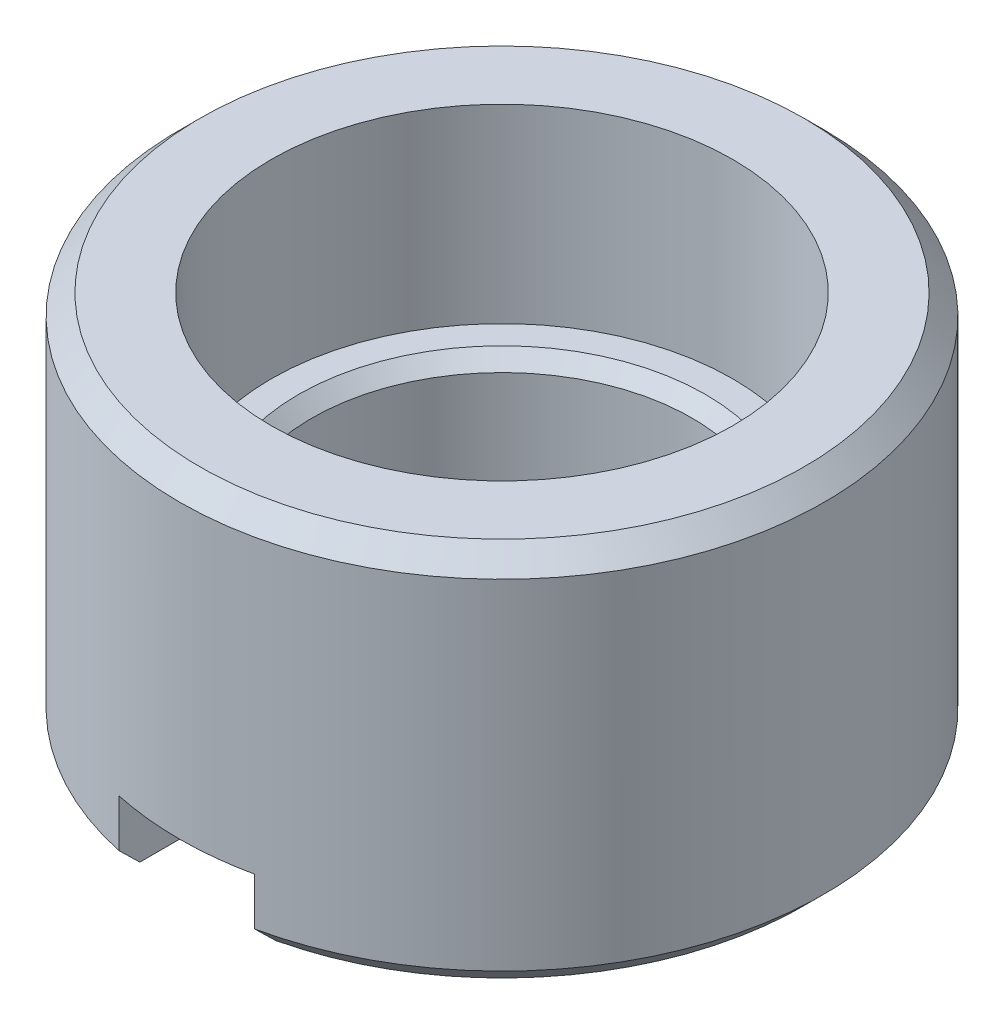
ISO-10303-21;
HEADER;
FILE_DESCRIPTION(('STEP AP214'),'2;1');
FILE_NAME('part.step','',(''),(''),'','','');
FILE_SCHEMA(('AUTOMOTIVE_DESIGN { 1 0 10303 214 1 1 1 1 }'));
ENDSEC;
DATA;
#1=APPLICATION_CONTEXT('core data for automotive mechanical design processes');
#2=APPLICATION_PROTOCOL_DEFINITION('international standard','automotive_design',2000,#1);
#3=PRODUCT_CONTEXT('',#1,'mechanical');
#4=PRODUCT('Part','Part','',(#3));
#5=PRODUCT_RELATED_PRODUCT_CATEGORY('part','',(#4));
#6=PRODUCT_DEFINITION_FORMATION('','',#4);
#7=PRODUCT_DEFINITION_CONTEXT('part definition',#1,'design');
#8=PRODUCT_DEFINITION('design','',#6,#7);
#9=PRODUCT_DEFINITION_SHAPE('','',#8);
#10=(LENGTH_UNIT() NAMED_UNIT(*) SI_UNIT(.MILLI.,.METRE.));
#11=(NAMED_UNIT(*) PLANE_ANGLE_UNIT() SI_UNIT($,.RADIAN.));
#12=(NAMED_UNIT(*) SI_UNIT($,.STERADIAN.) SOLID_ANGLE_UNIT());
#13=UNCERTAINTY_MEASURE_WITH_UNIT(LENGTH_MEASURE(1.E-05),#10,'distance_accuracy_value','');
#14=(GEOMETRIC_REPRESENTATION_CONTEXT(3) GLOBAL_UNCERTAINTY_ASSIGNED_CONTEXT((#13)) GLOBAL_UNIT_ASSIGNED_CONTEXT((#10,
#11,#12)) REPRESENTATION_CONTEXT('',''));
#15=CARTESIAN_POINT('',(0.,0.,0.));
#16=DIRECTION('',(0.,0.,1.));
#17=DIRECTION('',(1.,0.,0.));
#18=AXIS2_PLACEMENT_3D('',#15,#16,#17);
#19=CARTESIAN_POINT('',(0.,1.39999999993279,0.));
#20=DIRECTION('',(0.,1.,0.));
#21=DIRECTION('',(0.,0.,1.));
#22=AXIS2_PLACEMENT_3D('',#19,#20,#21);
#23=CONICAL_SURFACE('',#22,1.49999999990769,0.785398163397448);
#24=CARTESIAN_POINT('',(0.,1.39999999998963,0.));
#25=DIRECTION('',(0.,1.,0.));
#26=DIRECTION('',(0.,0.,1.));
#27=AXIS2_PLACEMENT_3D('',#24,#25,#26);
#28=CIRCLE('',#27,1.49999999996453);
#29=CARTESIAN_POINT('',(0.,1.39999999998963,1.49999999996453));
#30=VERTEX_POINT('',#29);
#31=EDGE_CURVE('E93',#30,#30,#28,.T.);
#32=ORIENTED_EDGE('',*,*,#31,.T.);
#33=EDGE_LOOP('',(#32));
#34=FACE_BOUND('',#33,.T.);
#35=CARTESIAN_POINT('',(0.,1.3,0.));
#36=DIRECTION('',(0.,1.,0.));
#37=DIRECTION('',(0.,0.,1.));
#38=AXIS2_PLACEMENT_3D('',#35,#36,#37);
#39=CIRCLE('',#38,1.4);
#40=CARTESIAN_POINT('',(0.,1.3,1.4));
#41=VERTEX_POINT('',#40);
#42=EDGE_CURVE('E90',#41,#41,#39,.F.);
#43=ORIENTED_EDGE('',*,*,#42,.T.);
#44=EDGE_LOOP('',(#43));
#45=FACE_BOUND('',#44,.T.);
#46=ADVANCED_FACE('F17',(#34,#45),#23,.F.);
#47=CARTESIAN_POINT('',(0.,0.,0.));
#48=DIRECTION('',(0.,1.,0.));
#49=DIRECTION('',(0.,0.,1.));
#50=AXIS2_PLACEMENT_3D('',#47,#48,#49);
#51=CYLINDRICAL_SURFACE('',#50,1.4);
#52=DIRECTION('',(0.,1.,0.));
#53=VECTOR('',#52,1.);
#54=CARTESIAN_POINT('',(-0.500000000000068,0.,1.30766968306218));
#55=LINE('',#54,#53);
#56=CARTESIAN_POINT('',(-0.500000000000034,0.15000000002292,1.30766968310323));
#57=VERTEX_POINT('',#56);
#58=CARTESIAN_POINT('',(-0.500000000000034,0.5,1.30766968306219));
#59=VERTEX_POINT('',#58);
#60=EDGE_CURVE('E66',#57,#59,#55,.T.);
#61=ORIENTED_EDGE('',*,*,#60,.F.);
#62=CARTESIAN_POINT('',(0.,0.15000000001919,0.));
#63=DIRECTION('',(0.,-1.,0.));
#64=DIRECTION('',(0.,0.,-1.));
#65=AXIS2_PLACEMENT_3D('',#62,#63,#64);
#66=CIRCLE('',#65,1.40000000010332);
#67=CARTESIAN_POINT('',(0.500000000000068,0.150000000061254,1.30766968306218));
#68=VERTEX_POINT('',#67);
#69=EDGE_CURVE('E89',#57,#68,#66,.T.);
#70=ORIENTED_EDGE('',*,*,#69,.T.);
#71=DIRECTION('',(0.,1.,0.));
#72=VECTOR('',#71,1.);
#73=CARTESIAN_POINT('',(0.500000000000068,0.,1.30766968306218));
#74=LINE('',#73,#72);
#75=CARTESIAN_POINT('',(0.500000000000034,0.5,1.30766968306219));
#76=VERTEX_POINT('',#75);
#77=EDGE_CURVE('E77',#76,#68,#74,.F.);
#78=ORIENTED_EDGE('',*,*,#77,.F.);
#79=CARTESIAN_POINT('',(0.,0.5,0.));
#80=DIRECTION('',(0.,1.,0.));
#81=DIRECTION('',(0.,0.,1.));
#82=AXIS2_PLACEMENT_3D('',#79,#80,#81);
#83=CIRCLE('',#82,1.4);
#84=EDGE_CURVE('E20',#59,#76,#83,.T.);
#85=ORIENTED_EDGE('',*,*,#84,.F.);
#86=EDGE_LOOP('',(#61,#70,#78,#85));
#87=FACE_BOUND('',#86,.T.);
#88=ORIENTED_EDGE('',*,*,#42,.F.);
#89=EDGE_LOOP('',(#88));
#90=FACE_BOUND('',#89,.T.);
#91=ADVANCED_FACE('F87',(#87,#90),#51,.F.);
#92=CARTESIAN_POINT('',(0.,1.4,0.));
#93=DIRECTION('',(0.,-1.,0.));
#94=DIRECTION('',(0.,0.,-1.));
#95=AXIS2_PLACEMENT_3D('',#92,#93,#94);
#96=PLANE('',#95);
#97=ORIENTED_EDGE('',*,*,#31,.F.);
#98=EDGE_LOOP('',(#97));
#99=FACE_BOUND('',#98,.T.);
#100=CARTESIAN_POINT('',(0.,1.4,0.));
#101=DIRECTION('',(0.,-1.,0.));
#102=DIRECTION('',(0.,0.,-1.));
#103=AXIS2_PLACEMENT_3D('',#100,#101,#102);
#104=CIRCLE('',#103,1.7);
#105=CARTESIAN_POINT('',(0.,1.4,-1.7));
#106=VERTEX_POINT('',#105);
#107=EDGE_CURVE('E151',#106,#106,#104,.F.);
#108=ORIENTED_EDGE('',*,*,#107,.T.);
#109=EDGE_LOOP('',(#108));
#110=FACE_BOUND('',#109,.T.);
#111=ADVANCED_FACE('F161',(#99,#110),#96,.F.);
#112=CARTESIAN_POINT('',(0.,0.,0.));
#113=DIRECTION('',(0.,-1.,0.));
#114=DIRECTION('',(0.,0.,-1.));
#115=AXIS2_PLACEMENT_3D('',#112,#113,#114);
#116=CONICAL_SURFACE('',#115,1.55000000006567,0.78539816320797);
#117=CARTESIAN_POINT('',(0.499999999981814,0.150000000035574,1.30766968313469));
#118=CARTESIAN_POINT('',(0.499999999990907,0.125087850550626,1.33433072214663));
#119=CARTESIAN_POINT('',(0.499999999996969,0.100131774063996,1.36095044282874));
#120=CARTESIAN_POINT('',(0.500000000003031,0.0501317740330847,1.41410724014906));
#121=CARTESIAN_POINT('',(0.500000000003031,0.0250878505132113,1.44064431681023));
#122=CARTESIAN_POINT('',(0.5,1.60643127711289E-11,1.46714007516452));
#123=B_SPLINE_CURVE_WITH_KNOTS('',3,(#117,#118,#119,#120,#121,#122),.UNSPECIFIED.,.F.,.F.,(4,2,
4),(0.,0.10946569117856,0.218931351944436),.UNSPECIFIED.);
#124=CARTESIAN_POINT('',(0.5,8.02214772254536E-12,1.46714007517302));
#125=VERTEX_POINT('',#124);
#126=EDGE_CURVE('E144',#68,#125,#123,.T.);
#127=ORIENTED_EDGE('',*,*,#126,.F.);
#128=ORIENTED_EDGE('',*,*,#69,.F.);
#129=CARTESIAN_POINT('',(-0.499999999994457,1.28525201491322E-11,1.46714007516152));
#130=CARTESIAN_POINT('',(-0.499999999997228,0.0250878505098879,1.44064431680714));
#131=CARTESIAN_POINT('',(-0.499999999999076,0.0501317740308252,1.41410724014697));
#132=CARTESIAN_POINT('',(-0.500000000000924,0.100131774066208,1.36095044283088));
#133=CARTESIAN_POINT('',(-0.500000000000924,0.125087850556246,1.33433072215198));
#134=CARTESIAN_POINT('',(-0.5,0.150000000045777,1.30766968314435));
#135=B_SPLINE_CURVE_WITH_KNOTS('',3,(#129,#130,#131,#132,#133,#134),.UNSPECIFIED.,.F.,.F.,(4,2,
4),(0.,0.10946566076587,0.218931351944392),.UNSPECIFIED.);
#136=CARTESIAN_POINT('',(-0.5,8.02201525868665E-12,1.46714007517302));
#137=VERTEX_POINT('',#136);
#138=EDGE_CURVE('E152',#137,#57,#135,.T.);
#139=ORIENTED_EDGE('',*,*,#138,.F.);
#140=CARTESIAN_POINT('',(0.,0.,0.));
#141=DIRECTION('',(0.,-1.,0.));
#142=DIRECTION('',(0.,0.,-1.));
#143=AXIS2_PLACEMENT_3D('',#140,#141,#142);
#144=CIRCLE('',#143,1.55000000006567);
#145=EDGE_CURVE('E197',#137,#125,#144,.T.);
#146=ORIENTED_EDGE('',*,*,#145,.T.);
#147=EDGE_LOOP('',(#127,#128,#139,#146));
#148=FACE_BOUND('',#147,.T.);
#149=ADVANCED_FACE('F156',(#148),#116,.F.);
#150=CARTESIAN_POINT('',(0.,2.8,0.));
#151=DIRECTION('',(0.,-1.,0.));
#152=DIRECTION('',(0.,0.,-1.));
#153=AXIS2_PLACEMENT_3D('',#150,#151,#152);
#154=CYLINDRICAL_SURFACE('',#153,1.7);
#155=CARTESIAN_POINT('',(0.,2.8,0.));
#156=DIRECTION('',(0.,-1.,0.));
#157=DIRECTION('',(0.,0.,-1.));
#158=AXIS2_PLACEMENT_3D('',#155,#156,#157);
#159=CIRCLE('',#158,1.7);
#160=CARTESIAN_POINT('',(0.,2.8,-1.7));
#161=VERTEX_POINT('',#160);
#162=EDGE_CURVE('E85',#161,#161,#159,.T.);
#163=ORIENTED_EDGE('',*,*,#162,.F.);
#164=EDGE_LOOP('',(#163));
#165=FACE_BOUND('',#164,.T.);
#166=ORIENTED_EDGE('',*,*,#107,.F.);
#167=EDGE_LOOP('',(#166));
#168=FACE_BOUND('',#167,.T.);
#169=ADVANCED_FACE('F160',(#165,#168),#154,.F.);
#170=CARTESIAN_POINT('',(0.,0.,0.));
#171=DIRECTION('',(0.,1.,0.));
#172=DIRECTION('',(0.,0.,1.));
#173=AXIS2_PLACEMENT_3D('',#170,#171,#172);
#174=PLANE('',#173);
#175=DIRECTION('',(0.,0.,1.));
#176=VECTOR('',#175,1.);
#177=CARTESIAN_POINT('',(-0.5,0.,3.));
#178=LINE('',#177,#176);
#179=CARTESIAN_POINT('',(-0.5,-8.84632695322834E-13,2.16809247958665));
#180=VERTEX_POINT('',#179);
#181=EDGE_CURVE('E202',#137,#180,#178,.T.);
#182=ORIENTED_EDGE('',*,*,#181,.T.);
#183=CARTESIAN_POINT('',(0.,0.,0.));
#184=DIRECTION('',(0.,1.,0.));
#185=DIRECTION('',(0.,0.,1.));
#186=AXIS2_PLACEMENT_3D('',#183,#184,#185);
#187=CIRCLE('',#186,2.22500000000991);
#188=CARTESIAN_POINT('',(0.5,0.,2.16809247958756));
#189=VERTEX_POINT('',#188);
#190=EDGE_CURVE('E114',#189,#180,#187,.T.);
#191=ORIENTED_EDGE('',*,*,#190,.F.);
#192=DIRECTION('',(0.,0.,-1.));
#193=VECTOR('',#192,1.);
#194=CARTESIAN_POINT('',(0.5,0.,0.));
#195=LINE('',#194,#193);
#196=EDGE_CURVE('E199',#189,#125,#195,.T.);
#197=ORIENTED_EDGE('',*,*,#196,.T.);
#198=ORIENTED_EDGE('',*,*,#145,.F.);
#199=EDGE_LOOP('',(#182,#191,#197,#198));
#200=FACE_BOUND('',#199,.T.);
#201=ADVANCED_FACE('F140',(#200),#174,.F.);
#202=CARTESIAN_POINT('',(0.5,0.,0.));
#203=DIRECTION('',(1.,0.,0.));
#204=DIRECTION('',(0.,0.,-1.));
#205=AXIS2_PLACEMENT_3D('',#202,#203,#204);
#206=PLANE('',#205);
#207=DIRECTION('',(0.,1.,0.));
#208=VECTOR('',#207,1.);
#209=CARTESIAN_POINT('',(0.499999999999967,0.,2.32177195262585));
#210=LINE('',#209,#208);
#211=CARTESIAN_POINT('',(0.499999999999983,0.5,2.32177195262584));
#212=VERTEX_POINT('',#211);
#213=CARTESIAN_POINT('',(0.499999999999983,0.150000000003367,2.32177195263436));
#214=VERTEX_POINT('',#213);
#215=EDGE_CURVE('E84',#212,#214,#210,.F.);
#216=ORIENTED_EDGE('',*,*,#215,.F.);
#217=DIRECTION('',(0.,0.,-1.));
#218=VECTOR('',#217,1.);
#219=CARTESIAN_POINT('',(0.5,0.5,0.));
#220=LINE('',#219,#218);
#221=EDGE_CURVE('E73',#76,#212,#220,.F.);
#222=ORIENTED_EDGE('',*,*,#221,.F.);
#223=ORIENTED_EDGE('',*,*,#77,.T.);
#224=ORIENTED_EDGE('',*,*,#126,.T.);
#225=ORIENTED_EDGE('',*,*,#196,.F.);
#226=CARTESIAN_POINT('',(0.5,0.150000000006734,2.32177195264287));
#227=CARTESIAN_POINT('',(0.5,0.124979267278892,2.29617894373316));
#228=CARTESIAN_POINT('',(0.5,0.0999689009809356,2.27057581659196));
#229=CARTESIAN_POINT('',(0.5,0.0499689009777126,2.21934932557296));
#230=CARTESIAN_POINT('',(0.5,0.0249792672726675,2.19372596169494));
#231=CARTESIAN_POINT('',(0.5,-2.27022831043389E-12,2.16809247958523));
#232=B_SPLINE_CURVE_WITH_KNOTS('',3,(#226,#227,#228,#229,#230,#231),.UNSPECIFIED.,.F.,.F.,(4,2,
4),(0.,0.107374796278718,0.21474959370455),.UNSPECIFIED.);
#233=EDGE_CURVE('E130',#214,#189,#232,.T.);
#234=ORIENTED_EDGE('',*,*,#233,.F.);
#235=EDGE_LOOP('',(#216,#222,#223,#224,#225,#234));
#236=FACE_BOUND('',#235,.T.);
#237=ADVANCED_FACE('F80',(#236),#206,.F.);
#238=CARTESIAN_POINT('',(-0.5,0.,3.));
#239=DIRECTION('',(-1.,0.,0.));
#240=DIRECTION('',(0.,0.,1.));
#241=AXIS2_PLACEMENT_3D('',#238,#239,#240);
#242=PLANE('',#241);
#243=ORIENTED_EDGE('',*,*,#60,.T.);
#244=DIRECTION('',(0.,0.,-1.));
#245=VECTOR('',#244,1.);
#246=CARTESIAN_POINT('',(-0.5,0.5,0.));
#247=LINE('',#246,#245);
#248=CARTESIAN_POINT('',(-0.499999999999983,0.5,2.32177195262584));
#249=VERTEX_POINT('',#248);
#250=EDGE_CURVE('E35',#249,#59,#247,.T.);
#251=ORIENTED_EDGE('',*,*,#250,.F.);
#252=DIRECTION('',(0.,1.,0.));
#253=VECTOR('',#252,1.);
#254=CARTESIAN_POINT('',(-0.499999999999967,0.,2.32177195262585));
#255=LINE('',#254,#253);
#256=CARTESIAN_POINT('',(-0.499999999999983,0.150000000003367,2.32177195263436));
#257=VERTEX_POINT('',#256);
#258=EDGE_CURVE('E105',#257,#249,#255,.T.);
#259=ORIENTED_EDGE('',*,*,#258,.F.);
#260=CARTESIAN_POINT('',(-0.5,-1.76922929641251E-12,2.16809247958574));
#261=CARTESIAN_POINT('',(-0.5,0.0249792672730852,2.19372596169537));
#262=CARTESIAN_POINT('',(-0.5,0.0499689009780469,2.2193493255733));
#263=CARTESIAN_POINT('',(-0.5,0.099968900981103,2.27057581659213));
#264=CARTESIAN_POINT('',(-0.5,0.124979267278976,2.29617894373324));
#265=CARTESIAN_POINT('',(-0.5,0.150000000006735,2.32177195264287));
#266=B_SPLINE_CURVE_WITH_KNOTS('',3,(#260,#261,#262,#263,#264,#265),.UNSPECIFIED.,.F.,.F.,(4,2,
4),(0.,0.107374797425473,0.214749593703833),.UNSPECIFIED.);
#267=EDGE_CURVE('E106',#180,#257,#266,.T.);
#268=ORIENTED_EDGE('',*,*,#267,.F.);
#269=ORIENTED_EDGE('',*,*,#181,.F.);
#270=ORIENTED_EDGE('',*,*,#138,.T.);
#271=EDGE_LOOP('',(#243,#251,#259,#268,#269,#270));
#272=FACE_BOUND('',#271,.T.);
#273=ADVANCED_FACE('F116',(#272),#242,.F.);
#274=CARTESIAN_POINT('',(0.,0.5,0.));
#275=DIRECTION('',(0.,-1.,0.));
#276=DIRECTION('',(0.,0.,-1.));
#277=AXIS2_PLACEMENT_3D('',#274,#275,#276);
#278=PLANE('',#277);
#279=ORIENTED_EDGE('',*,*,#221,.T.);
#280=CARTESIAN_POINT('',(0.,0.5,0.));
#281=DIRECTION('',(0.,1.,0.));
#282=DIRECTION('',(0.,0.,1.));
#283=AXIS2_PLACEMENT_3D('',#280,#281,#282);
#284=CIRCLE('',#283,2.375);
#285=EDGE_CURVE('E103',#249,#212,#284,.T.);
#286=ORIENTED_EDGE('',*,*,#285,.F.);
#287=ORIENTED_EDGE('',*,*,#250,.T.);
#288=ORIENTED_EDGE('',*,*,#84,.T.);
#289=EDGE_LOOP('',(#279,#286,#287,#288));
#290=FACE_BOUND('',#289,.T.);
#291=ADVANCED_FACE('F72',(#290),#278,.T.);
#292=CARTESIAN_POINT('',(0.,2.8,0.));
#293=DIRECTION('',(0.,1.,0.));
#294=DIRECTION('',(0.,0.,1.));
#295=AXIS2_PLACEMENT_3D('',#292,#293,#294);
#296=PLANE('',#295);
#297=ORIENTED_EDGE('',*,*,#162,.T.);
#298=EDGE_LOOP('',(#297));
#299=FACE_BOUND('',#298,.T.);
#300=CARTESIAN_POINT('',(0.,2.79999999992242,0.));
#301=DIRECTION('',(0.,-1.,0.));
#302=DIRECTION('',(0.,0.,-1.));
#303=AXIS2_PLACEMENT_3D('',#300,#301,#302);
#304=CIRCLE('',#303,2.22500000000991);
#305=CARTESIAN_POINT('',(0.,2.79999999992242,-2.22500000000991));
#306=VERTEX_POINT('',#305);
#307=EDGE_CURVE('E100',#306,#306,#304,.T.);
#308=ORIENTED_EDGE('',*,*,#307,.F.);
#309=EDGE_LOOP('',(#308));
#310=FACE_BOUND('',#309,.T.);
#311=ADVANCED_FACE('F126',(#299,#310),#296,.T.);
#312=CARTESIAN_POINT('',(0.,0.149999999962347,0.));
#313=DIRECTION('',(0.,1.,0.));
#314=DIRECTION('',(0.,0.,1.));
#315=AXIS2_PLACEMENT_3D('',#312,#313,#314);
#316=CONICAL_SURFACE('',#315,2.37499999997226,0.785398163397448);
#317=ORIENTED_EDGE('',*,*,#267,.T.);
#318=CARTESIAN_POINT('',(0.,0.15,0.));
#319=DIRECTION('',(0.,1.,0.));
#320=DIRECTION('',(0.,0.,1.));
#321=AXIS2_PLACEMENT_3D('',#318,#319,#320);
#322=CIRCLE('',#321,2.375);
#323=EDGE_CURVE('E26',#214,#257,#322,.T.);
#324=ORIENTED_EDGE('',*,*,#323,.F.);
#325=ORIENTED_EDGE('',*,*,#233,.T.);
#326=ORIENTED_EDGE('',*,*,#190,.T.);
#327=EDGE_LOOP('',(#317,#324,#325,#326));
#328=FACE_BOUND('',#327,.T.);
#329=ADVANCED_FACE('F120',(#328),#316,.T.);
#330=CARTESIAN_POINT('',(0.,2.65000000007376,0.));
#331=DIRECTION('',(0.,-1.,0.));
#332=DIRECTION('',(0.,0.,-1.));
#333=AXIS2_PLACEMENT_3D('',#330,#331,#332);
#334=CONICAL_SURFACE('',#333,2.37499999985857,0.785398163397448);
#335=CARTESIAN_POINT('',(0.,2.65,0.));
#336=DIRECTION('',(0.,1.,0.));
#337=DIRECTION('',(0.,0.,1.));
#338=AXIS2_PLACEMENT_3D('',#335,#336,#337);
#339=CIRCLE('',#338,2.375);
#340=CARTESIAN_POINT('',(0.,2.65,2.375));
#341=VERTEX_POINT('',#340);
#342=EDGE_CURVE('E11',#341,#341,#339,.F.);
#343=ORIENTED_EDGE('',*,*,#342,.F.);
#344=EDGE_LOOP('',(#343));
#345=FACE_BOUND('',#344,.T.);
#346=ORIENTED_EDGE('',*,*,#307,.T.);
#347=EDGE_LOOP('',(#346));
#348=FACE_BOUND('',#347,.T.);
#349=ADVANCED_FACE('F125',(#345,#348),#334,.T.);
#350=CARTESIAN_POINT('',(0.,0.,0.));
#351=DIRECTION('',(0.,1.,0.));
#352=DIRECTION('',(0.,0.,1.));
#353=AXIS2_PLACEMENT_3D('',#350,#351,#352);
#354=CYLINDRICAL_SURFACE('',#353,2.375);
#355=ORIENTED_EDGE('',*,*,#215,.T.);
#356=ORIENTED_EDGE('',*,*,#323,.T.);
#357=ORIENTED_EDGE('',*,*,#258,.T.);
#358=ORIENTED_EDGE('',*,*,#285,.T.);
#359=EDGE_LOOP('',(#355,#356,#357,#358));
#360=FACE_BOUND('',#359,.T.);
#361=ORIENTED_EDGE('',*,*,#342,.T.);
#362=EDGE_LOOP('',(#361));
#363=FACE_BOUND('',#362,.T.);
#364=ADVANCED_FACE('F172',(#360,#363),#354,.T.);
#365=CLOSED_SHELL('',(#46,#91,#111,#149,#169,#201,#237,#273,#291,#311,#329,#349,#364));
#366=MANIFOLD_SOLID_BREP('B1',#365);
#367=ADVANCED_BREP_SHAPE_REPRESENTATION('',(#18,#366),#14);
#368=SHAPE_DEFINITION_REPRESENTATION(#9,#367);
ENDSEC;
END-ISO-10303-21;
